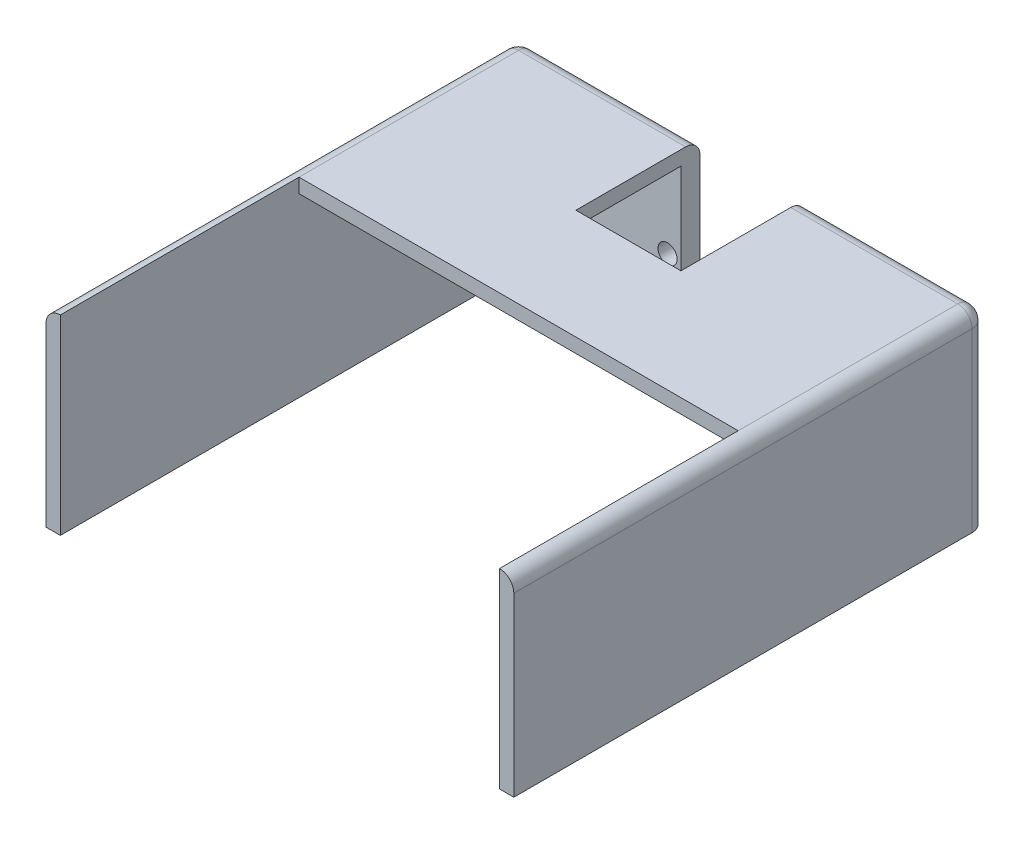
ISO-10303-21;
HEADER;
FILE_DESCRIPTION(('STEP AP214'),'2;1');
FILE_NAME('part.step','',(''),(''),'','','');
FILE_SCHEMA(('AUTOMOTIVE_DESIGN { 1 0 10303 214 1 1 1 1 }'));
ENDSEC;
DATA;
#1=APPLICATION_CONTEXT('core data for automotive mechanical design processes');
#2=APPLICATION_PROTOCOL_DEFINITION('international standard','automotive_design',2000,#1);
#3=PRODUCT_CONTEXT('',#1,'mechanical');
#4=PRODUCT('Part','Part','',(#3));
#5=PRODUCT_RELATED_PRODUCT_CATEGORY('part','',(#4));
#6=PRODUCT_DEFINITION_FORMATION('','',#4);
#7=PRODUCT_DEFINITION_CONTEXT('part definition',#1,'design');
#8=PRODUCT_DEFINITION('design','',#6,#7);
#9=PRODUCT_DEFINITION_SHAPE('','',#8);
#10=(LENGTH_UNIT() NAMED_UNIT(*) SI_UNIT(.MILLI.,.METRE.));
#11=(NAMED_UNIT(*) PLANE_ANGLE_UNIT() SI_UNIT($,.RADIAN.));
#12=(NAMED_UNIT(*) SI_UNIT($,.STERADIAN.) SOLID_ANGLE_UNIT());
#13=UNCERTAINTY_MEASURE_WITH_UNIT(LENGTH_MEASURE(1.E-05),#10,'distance_accuracy_value','');
#14=(GEOMETRIC_REPRESENTATION_CONTEXT(3) GLOBAL_UNCERTAINTY_ASSIGNED_CONTEXT((#13)) GLOBAL_UNIT_ASSIGNED_CONTEXT((#10,
#11,#12)) REPRESENTATION_CONTEXT('',''));
#15=CARTESIAN_POINT('',(0.,0.,0.));
#16=DIRECTION('',(0.,0.,1.));
#17=DIRECTION('',(1.,0.,0.));
#18=AXIS2_PLACEMENT_3D('',#15,#16,#17);
#19=CARTESIAN_POINT('',(0.,17.,3.));
#20=DIRECTION('',(-1.,0.,0.));
#21=DIRECTION('',(0.,-1.,0.));
#22=AXIS2_PLACEMENT_3D('',#19,#20,#21);
#23=CYLINDRICAL_SURFACE('',#22,3.);
#24=CARTESIAN_POINT('',(11.,17.,3.));
#25=DIRECTION('',(1.,0.,0.));
#26=DIRECTION('',(0.,1.,0.));
#27=AXIS2_PLACEMENT_3D('',#24,#25,#26);
#28=CIRCLE('',#27,3.);
#29=CARTESIAN_POINT('',(11.,20.,3.));
#30=VERTEX_POINT('',#29);
#31=CARTESIAN_POINT('',(11.,17.,0.));
#32=VERTEX_POINT('',#31);
#33=EDGE_CURVE('E46',#30,#32,#28,.F.);
#34=ORIENTED_EDGE('',*,*,#33,.F.);
#35=DIRECTION('',(1.,0.,0.));
#36=VECTOR('',#35,1.);
#37=CARTESIAN_POINT('',(-46.,20.,3.));
#38=LINE('',#37,#36);
#39=CARTESIAN_POINT('',(46.,20.,3.));
#40=VERTEX_POINT('',#39);
#41=EDGE_CURVE('E303',#40,#30,#38,.F.);
#42=ORIENTED_EDGE('',*,*,#41,.F.);
#43=CARTESIAN_POINT('',(46.,17.,3.));
#44=DIRECTION('',(-1.,0.,0.));
#45=DIRECTION('',(0.,0.,1.));
#46=AXIS2_PLACEMENT_3D('',#43,#44,#45);
#47=CIRCLE('',#46,3.);
#48=CARTESIAN_POINT('',(46.,17.,0.));
#49=VERTEX_POINT('',#48);
#50=EDGE_CURVE('E321',#40,#49,#47,.T.);
#51=ORIENTED_EDGE('',*,*,#50,.T.);
#52=DIRECTION('',(1.,0.,0.));
#53=VECTOR('',#52,1.);
#54=CARTESIAN_POINT('',(46.,17.,0.));
#55=LINE('',#54,#53);
#56=EDGE_CURVE('E296',#32,#49,#55,.T.);
#57=ORIENTED_EDGE('',*,*,#56,.F.);
#58=EDGE_LOOP('',(#34,#42,#51,#57));
#59=FACE_BOUND('',#58,.T.);
#60=ADVANCED_FACE('F38',(#59),#23,.T.);
#61=CARTESIAN_POINT('',(0.,0.,4.));
#62=DIRECTION('',(0.,0.,1.));
#63=DIRECTION('',(1.,0.,0.));
#64=AXIS2_PLACEMENT_3D('',#61,#62,#63);
#65=PLANE('',#64);
#66=CARTESIAN_POINT('',(-13.8,-0.300220534192911,4.));
#67=DIRECTION('',(0.,0.,1.));
#68=DIRECTION('',(1.,0.,0.));
#69=AXIS2_PLACEMENT_3D('',#66,#67,#68);
#70=CIRCLE('',#69,2.);
#71=CARTESIAN_POINT('',(-11.8,-0.300220534192911,4.));
#72=VERTEX_POINT('',#71);
#73=EDGE_CURVE('E201',#72,#72,#70,.T.);
#74=ORIENTED_EDGE('',*,*,#73,.F.);
#75=EDGE_LOOP('',(#74));
#76=FACE_BOUND('',#75,.T.);
#77=CARTESIAN_POINT('',(13.7335873865673,-10.3,4.));
#78=DIRECTION('',(0.,0.,1.));
#79=DIRECTION('',(1.,0.,0.));
#80=AXIS2_PLACEMENT_3D('',#77,#78,#79);
#81=CIRCLE('',#80,2.00000000000001);
#82=CARTESIAN_POINT('',(15.7335873865673,-10.3,4.));
#83=VERTEX_POINT('',#82);
#84=EDGE_CURVE('E669',#83,#83,#81,.T.);
#85=ORIENTED_EDGE('',*,*,#84,.F.);
#86=EDGE_LOOP('',(#85));
#87=FACE_BOUND('',#86,.T.);
#88=CARTESIAN_POINT('',(-13.7335873865673,-10.3,4.));
#89=DIRECTION('',(0.,0.,1.));
#90=DIRECTION('',(1.,0.,0.));
#91=AXIS2_PLACEMENT_3D('',#88,#89,#90);
#92=CIRCLE('',#91,2.00000000000001);
#93=CARTESIAN_POINT('',(-11.7335873865673,-10.3,4.));
#94=VERTEX_POINT('',#93);
#95=EDGE_CURVE('E666',#94,#94,#92,.T.);
#96=ORIENTED_EDGE('',*,*,#95,.F.);
#97=EDGE_LOOP('',(#96));
#98=FACE_BOUND('',#97,.T.);
#99=CARTESIAN_POINT('',(4.99999999999999,-15.,4.));
#100=DIRECTION('',(0.,0.,1.));
#101=DIRECTION('',(1.,0.,0.));
#102=AXIS2_PLACEMENT_3D('',#99,#100,#101);
#103=CIRCLE('',#102,2.);
#104=CARTESIAN_POINT('',(6.99999999999999,-15.,4.));
#105=VERTEX_POINT('',#104);
#106=EDGE_CURVE('E663',#105,#105,#103,.T.);
#107=ORIENTED_EDGE('',*,*,#106,.F.);
#108=EDGE_LOOP('',(#107));
#109=FACE_BOUND('',#108,.T.);
#110=CARTESIAN_POINT('',(13.8,-0.300220534192911,4.));
#111=DIRECTION('',(0.,0.,1.));
#112=DIRECTION('',(1.,0.,0.));
#113=AXIS2_PLACEMENT_3D('',#110,#111,#112);
#114=CIRCLE('',#113,2.);
#115=CARTESIAN_POINT('',(15.8,-0.300220534192911,4.));
#116=VERTEX_POINT('',#115);
#117=EDGE_CURVE('E660',#116,#116,#114,.T.);
#118=ORIENTED_EDGE('',*,*,#117,.F.);
#119=EDGE_LOOP('',(#118));
#120=FACE_BOUND('',#119,.T.);
#121=CARTESIAN_POINT('',(-5.00000000000001,-15.,4.));
#122=DIRECTION('',(0.,0.,1.));
#123=DIRECTION('',(1.,0.,0.));
#124=AXIS2_PLACEMENT_3D('',#121,#122,#123);
#125=CIRCLE('',#124,2.);
#126=CARTESIAN_POINT('',(-3.00000000000001,-15.,4.));
#127=VERTEX_POINT('',#126);
#128=EDGE_CURVE('E657',#127,#127,#125,.T.);
#129=ORIENTED_EDGE('',*,*,#128,.F.);
#130=EDGE_LOOP('',(#129));
#131=FACE_BOUND('',#130,.T.);
#132=DIRECTION('',(0.,1.,0.));
#133=VECTOR('',#132,1.);
#134=CARTESIAN_POINT('',(11.,0.,4.));
#135=LINE('',#134,#133);
#136=CARTESIAN_POINT('',(11.,-9.99999999999999,4.));
#137=VERTEX_POINT('',#136);
#138=CARTESIAN_POINT('',(11.,17.,4.));
#139=VERTEX_POINT('',#138);
#140=EDGE_CURVE('E214',#137,#139,#135,.T.);
#141=ORIENTED_EDGE('',*,*,#140,.F.);
#142=DIRECTION('',(1.,0.,0.));
#143=VECTOR('',#142,1.);
#144=CARTESIAN_POINT('',(0.,-9.99999999999999,4.));
#145=LINE('',#144,#143);
#146=CARTESIAN_POINT('',(-11.,-9.99999999999999,4.));
#147=VERTEX_POINT('',#146);
#148=EDGE_CURVE('E216',#147,#137,#145,.T.);
#149=ORIENTED_EDGE('',*,*,#148,.F.);
#150=DIRECTION('',(0.,-1.,0.));
#151=VECTOR('',#150,1.);
#152=CARTESIAN_POINT('',(-11.,0.,4.));
#153=LINE('',#152,#151);
#154=CARTESIAN_POINT('',(-11.,17.,4.));
#155=VERTEX_POINT('',#154);
#156=EDGE_CURVE('E209',#155,#147,#153,.T.);
#157=ORIENTED_EDGE('',*,*,#156,.F.);
#158=DIRECTION('',(1.,0.,0.));
#159=VECTOR('',#158,1.);
#160=CARTESIAN_POINT('',(-46.,17.,4.));
#161=LINE('',#160,#159);
#162=CARTESIAN_POINT('',(-46.,17.,4.));
#163=VERTEX_POINT('',#162);
#164=EDGE_CURVE('E223',#163,#155,#161,.T.);
#165=ORIENTED_EDGE('',*,*,#164,.F.);
#166=DIRECTION('',(0.,1.,0.));
#167=VECTOR('',#166,1.);
#168=CARTESIAN_POINT('',(-46.,-20.,4.));
#169=LINE('',#168,#167);
#170=CARTESIAN_POINT('',(-46.,-20.,4.));
#171=VERTEX_POINT('',#170);
#172=EDGE_CURVE('E238',#171,#163,#169,.T.);
#173=ORIENTED_EDGE('',*,*,#172,.F.);
#174=DIRECTION('',(1.,0.,0.));
#175=VECTOR('',#174,1.);
#176=CARTESIAN_POINT('',(0.,-20.,4.));
#177=LINE('',#176,#175);
#178=CARTESIAN_POINT('',(46.,-20.,4.));
#179=VERTEX_POINT('',#178);
#180=EDGE_CURVE('E274',#171,#179,#177,.T.);
#181=ORIENTED_EDGE('',*,*,#180,.T.);
#182=DIRECTION('',(0.,-1.,0.));
#183=VECTOR('',#182,1.);
#184=CARTESIAN_POINT('',(46.,-20.,4.));
#185=LINE('',#184,#183);
#186=CARTESIAN_POINT('',(46.,17.,4.));
#187=VERTEX_POINT('',#186);
#188=EDGE_CURVE('E255',#187,#179,#185,.T.);
#189=ORIENTED_EDGE('',*,*,#188,.F.);
#190=EDGE_CURVE('E233',#139,#187,#161,.T.);
#191=ORIENTED_EDGE('',*,*,#190,.F.);
#192=EDGE_LOOP('',(#141,#149,#157,#165,#173,#181,#189,#191));
#193=FACE_BOUND('',#192,.T.);
#194=ADVANCED_FACE('F399',(#76,#87,#98,#109,#120,#131,#193),#65,.T.);
#195=CARTESIAN_POINT('',(46.,-20.,99.));
#196=DIRECTION('',(1.,0.,0.));
#197=DIRECTION('',(0.,0.,-1.));
#198=AXIS2_PLACEMENT_3D('',#195,#196,#197);
#199=PLANE('',#198);
#200=DIRECTION('',(0.,0.,-1.));
#201=VECTOR('',#200,1.);
#202=CARTESIAN_POINT('',(46.,17.,49.));
#203=LINE('',#202,#201);
#204=CARTESIAN_POINT('',(46.,17.,49.));
#205=VERTEX_POINT('',#204);
#206=EDGE_CURVE('E230',#205,#187,#203,.T.);
#207=ORIENTED_EDGE('',*,*,#206,.T.);
#208=ORIENTED_EDGE('',*,*,#188,.T.);
#209=DIRECTION('',(0.,0.,-1.));
#210=VECTOR('',#209,1.);
#211=CARTESIAN_POINT('',(46.,-20.,99.));
#212=LINE('',#211,#210);
#213=CARTESIAN_POINT('',(46.,-20.,99.));
#214=VERTEX_POINT('',#213);
#215=EDGE_CURVE('E264',#214,#179,#212,.T.);
#216=ORIENTED_EDGE('',*,*,#215,.F.);
#217=DIRECTION('',(0.,-1.,0.));
#218=VECTOR('',#217,1.);
#219=CARTESIAN_POINT('',(46.,-20.,99.));
#220=LINE('',#219,#218);
#221=CARTESIAN_POINT('',(46.,20.,99.));
#222=VERTEX_POINT('',#221);
#223=EDGE_CURVE('E259',#222,#214,#220,.T.);
#224=ORIENTED_EDGE('',*,*,#223,.F.);
#225=DIRECTION('',(0.,0.,-1.));
#226=VECTOR('',#225,1.);
#227=CARTESIAN_POINT('',(46.,20.,99.));
#228=LINE('',#227,#226);
#229=CARTESIAN_POINT('',(46.,20.,49.));
#230=VERTEX_POINT('',#229);
#231=EDGE_CURVE('E268',#222,#230,#228,.T.);
#232=ORIENTED_EDGE('',*,*,#231,.T.);
#233=DIRECTION('',(0.,1.,0.));
#234=VECTOR('',#233,1.);
#235=CARTESIAN_POINT('',(46.,20.,49.));
#236=LINE('',#235,#234);
#237=EDGE_CURVE('E225',#205,#230,#236,.T.);
#238=ORIENTED_EDGE('',*,*,#237,.F.);
#239=EDGE_LOOP('',(#207,#208,#216,#224,#232,#238));
#240=FACE_BOUND('',#239,.T.);
#241=ADVANCED_FACE('F362',(#240),#199,.F.);
#242=CARTESIAN_POINT('',(-46.,-20.,99.));
#243=DIRECTION('',(-1.,0.,0.));
#244=DIRECTION('',(0.,0.,1.));
#245=AXIS2_PLACEMENT_3D('',#242,#243,#244);
#246=PLANE('',#245);
#247=DIRECTION('',(0.,0.,-1.));
#248=VECTOR('',#247,1.);
#249=CARTESIAN_POINT('',(-46.,17.,49.));
#250=LINE('',#249,#248);
#251=CARTESIAN_POINT('',(-46.,17.,49.));
#252=VERTEX_POINT('',#251);
#253=EDGE_CURVE('E236',#252,#163,#250,.T.);
#254=ORIENTED_EDGE('',*,*,#253,.F.);
#255=DIRECTION('',(0.,-1.,0.));
#256=VECTOR('',#255,1.);
#257=CARTESIAN_POINT('',(-46.,20.,49.));
#258=LINE('',#257,#256);
#259=CARTESIAN_POINT('',(-46.,20.,49.));
#260=VERTEX_POINT('',#259);
#261=EDGE_CURVE('E219',#260,#252,#258,.T.);
#262=ORIENTED_EDGE('',*,*,#261,.F.);
#263=DIRECTION('',(0.,0.,-1.));
#264=VECTOR('',#263,1.);
#265=CARTESIAN_POINT('',(-46.,20.,99.));
#266=LINE('',#265,#264);
#267=CARTESIAN_POINT('',(-46.,20.,99.));
#268=VERTEX_POINT('',#267);
#269=EDGE_CURVE('E249',#268,#260,#266,.T.);
#270=ORIENTED_EDGE('',*,*,#269,.F.);
#271=DIRECTION('',(0.,1.,0.));
#272=VECTOR('',#271,1.);
#273=CARTESIAN_POINT('',(-46.,-20.,99.));
#274=LINE('',#273,#272);
#275=CARTESIAN_POINT('',(-46.,-20.,99.));
#276=VERTEX_POINT('',#275);
#277=EDGE_CURVE('E239',#276,#268,#274,.T.);
#278=ORIENTED_EDGE('',*,*,#277,.F.);
#279=DIRECTION('',(0.,0.,-1.));
#280=VECTOR('',#279,1.);
#281=CARTESIAN_POINT('',(-46.,-20.,99.));
#282=LINE('',#281,#280);
#283=EDGE_CURVE('E245',#276,#171,#282,.T.);
#284=ORIENTED_EDGE('',*,*,#283,.T.);
#285=ORIENTED_EDGE('',*,*,#172,.T.);
#286=EDGE_LOOP('',(#254,#262,#270,#278,#284,#285));
#287=FACE_BOUND('',#286,.T.);
#288=ADVANCED_FACE('F408',(#287),#246,.F.);
#289=CARTESIAN_POINT('',(0.,-20.,4.));
#290=DIRECTION('',(0.,1.,0.));
#291=DIRECTION('',(0.,0.,1.));
#292=AXIS2_PLACEMENT_3D('',#289,#290,#291);
#293=PLANE('',#292);
#294=DIRECTION('',(1.,0.,0.));
#295=VECTOR('',#294,1.);
#296=CARTESIAN_POINT('',(0.,-20.,0.));
#297=LINE('',#296,#295);
#298=CARTESIAN_POINT('',(-46.,-20.,0.));
#299=VERTEX_POINT('',#298);
#300=CARTESIAN_POINT('',(46.,-20.,0.));
#301=VERTEX_POINT('',#300);
#302=EDGE_CURVE('E273',#299,#301,#297,.T.);
#303=ORIENTED_EDGE('',*,*,#302,.T.);
#304=CARTESIAN_POINT('',(46.,-20.,3.));
#305=DIRECTION('',(0.,1.,0.));
#306=DIRECTION('',(0.,0.,1.));
#307=AXIS2_PLACEMENT_3D('',#304,#305,#306);
#308=CIRCLE('',#307,3.);
#309=CARTESIAN_POINT('',(49.,-20.,3.));
#310=VERTEX_POINT('',#309);
#311=EDGE_CURVE('E286',#301,#310,#308,.F.);
#312=ORIENTED_EDGE('',*,*,#311,.T.);
#313=DIRECTION('',(0.,0.,1.));
#314=VECTOR('',#313,1.);
#315=CARTESIAN_POINT('',(49.,-20.,0.));
#316=LINE('',#315,#314);
#317=CARTESIAN_POINT('',(49.,-20.,99.));
#318=VERTEX_POINT('',#317);
#319=EDGE_CURVE('E271',#310,#318,#316,.T.);
#320=ORIENTED_EDGE('',*,*,#319,.T.);
#321=DIRECTION('',(1.,0.,0.));
#322=VECTOR('',#321,1.);
#323=CARTESIAN_POINT('',(49.,-20.,99.));
#324=LINE('',#323,#322);
#325=EDGE_CURVE('E261',#214,#318,#324,.T.);
#326=ORIENTED_EDGE('',*,*,#325,.F.);
#327=ORIENTED_EDGE('',*,*,#215,.T.);
#328=ORIENTED_EDGE('',*,*,#180,.F.);
#329=ORIENTED_EDGE('',*,*,#283,.F.);
#330=DIRECTION('',(1.,0.,0.));
#331=VECTOR('',#330,1.);
#332=CARTESIAN_POINT('',(-49.,-20.,99.));
#333=LINE('',#332,#331);
#334=CARTESIAN_POINT('',(-49.,-20.,99.));
#335=VERTEX_POINT('',#334);
#336=EDGE_CURVE('E243',#335,#276,#333,.T.);
#337=ORIENTED_EDGE('',*,*,#336,.F.);
#338=DIRECTION('',(0.,0.,1.));
#339=VECTOR('',#338,1.);
#340=CARTESIAN_POINT('',(-49.,-20.,0.));
#341=LINE('',#340,#339);
#342=CARTESIAN_POINT('',(-49.,-20.,3.));
#343=VERTEX_POINT('',#342);
#344=EDGE_CURVE('E252',#343,#335,#341,.T.);
#345=ORIENTED_EDGE('',*,*,#344,.F.);
#346=CARTESIAN_POINT('',(-46.,-20.,3.));
#347=DIRECTION('',(0.,1.,0.));
#348=DIRECTION('',(0.,0.,1.));
#349=AXIS2_PLACEMENT_3D('',#346,#347,#348);
#350=CIRCLE('',#349,3.);
#351=EDGE_CURVE('E284',#343,#299,#350,.F.);
#352=ORIENTED_EDGE('',*,*,#351,.T.);
#353=EDGE_LOOP('',(#303,#312,#320,#326,#327,#328,#329,#337,#345,#352));
#354=FACE_BOUND('',#353,.T.);
#355=ADVANCED_FACE('F368',(#354),#293,.F.);
#356=CARTESIAN_POINT('',(0.,20.,4.));
#357=DIRECTION('',(0.,1.,0.));
#358=DIRECTION('',(-1.,0.,0.));
#359=AXIS2_PLACEMENT_3D('',#356,#357,#358);
#360=PLANE('',#359);
#361=DIRECTION('',(0.,0.,-1.));
#362=VECTOR('',#361,1.);
#363=CARTESIAN_POINT('',(11.,20.,26.));
#364=LINE('',#363,#362);
#365=CARTESIAN_POINT('',(11.,20.,26.));
#366=VERTEX_POINT('',#365);
#367=EDGE_CURVE('E187',#366,#30,#364,.T.);
#368=ORIENTED_EDGE('',*,*,#367,.F.);
#369=DIRECTION('',(1.,0.,0.));
#370=VECTOR('',#369,1.);
#371=CARTESIAN_POINT('',(11.,20.,26.));
#372=LINE('',#371,#370);
#373=CARTESIAN_POINT('',(-11.,20.,26.));
#374=VERTEX_POINT('',#373);
#375=EDGE_CURVE('E176',#374,#366,#372,.T.);
#376=ORIENTED_EDGE('',*,*,#375,.F.);
#377=DIRECTION('',(0.,0.,-1.));
#378=VECTOR('',#377,1.);
#379=CARTESIAN_POINT('',(-11.,20.,26.));
#380=LINE('',#379,#378);
#381=CARTESIAN_POINT('',(-11.,20.,3.));
#382=VERTEX_POINT('',#381);
#383=EDGE_CURVE('E182',#374,#382,#380,.T.);
#384=ORIENTED_EDGE('',*,*,#383,.T.);
#385=CARTESIAN_POINT('',(-46.,20.,3.));
#386=VERTEX_POINT('',#385);
#387=EDGE_CURVE('E302',#382,#386,#38,.F.);
#388=ORIENTED_EDGE('',*,*,#387,.T.);
#389=DIRECTION('',(0.,0.,1.));
#390=VECTOR('',#389,1.);
#391=CARTESIAN_POINT('',(-46.,20.,99.));
#392=LINE('',#391,#390);
#393=EDGE_CURVE('E305',#386,#260,#392,.T.);
#394=ORIENTED_EDGE('',*,*,#393,.T.);
#395=DIRECTION('',(-1.,0.,0.));
#396=VECTOR('',#395,1.);
#397=CARTESIAN_POINT('',(-46.,20.,49.));
#398=LINE('',#397,#396);
#399=EDGE_CURVE('E227',#230,#260,#398,.T.);
#400=ORIENTED_EDGE('',*,*,#399,.F.);
#401=DIRECTION('',(0.,0.,1.));
#402=VECTOR('',#401,1.);
#403=CARTESIAN_POINT('',(46.,20.,3.));
#404=LINE('',#403,#402);
#405=EDGE_CURVE('E300',#230,#40,#404,.F.);
#406=ORIENTED_EDGE('',*,*,#405,.T.);
#407=ORIENTED_EDGE('',*,*,#41,.T.);
#408=EDGE_LOOP('',(#368,#376,#384,#388,#394,#400,#406,#407));
#409=FACE_BOUND('',#408,.T.);
#410=ADVANCED_FACE('F190',(#409),#360,.T.);
#411=CARTESIAN_POINT('',(0.,0.,0.));
#412=DIRECTION('',(0.,0.,1.));
#413=DIRECTION('',(1.,0.,0.));
#414=AXIS2_PLACEMENT_3D('',#411,#412,#413);
#415=PLANE('',#414);
#416=CARTESIAN_POINT('',(-13.8,-0.300220534192911,0.));
#417=DIRECTION('',(0.,0.,-1.));
#418=DIRECTION('',(-1.,0.,0.));
#419=AXIS2_PLACEMENT_3D('',#416,#417,#418);
#420=CIRCLE('',#419,2.);
#421=CARTESIAN_POINT('',(-15.8,-0.300220534192911,0.));
#422=VERTEX_POINT('',#421);
#423=EDGE_CURVE('E639',#422,#422,#420,.T.);
#424=ORIENTED_EDGE('',*,*,#423,.F.);
#425=EDGE_LOOP('',(#424));
#426=FACE_BOUND('',#425,.T.);
#427=CARTESIAN_POINT('',(13.7335873865673,-10.3,0.));
#428=DIRECTION('',(0.,0.,-1.));
#429=DIRECTION('',(1.,0.,0.));
#430=AXIS2_PLACEMENT_3D('',#427,#428,#429);
#431=CIRCLE('',#430,2.00000000000001);
#432=CARTESIAN_POINT('',(15.7335873865673,-10.3,0.));
#433=VERTEX_POINT('',#432);
#434=EDGE_CURVE('E640',#433,#433,#431,.T.);
#435=ORIENTED_EDGE('',*,*,#434,.F.);
#436=EDGE_LOOP('',(#435));
#437=FACE_BOUND('',#436,.T.);
#438=CARTESIAN_POINT('',(-13.7335873865673,-10.3,0.));
#439=DIRECTION('',(0.,0.,-1.));
#440=DIRECTION('',(-1.,0.,0.));
#441=AXIS2_PLACEMENT_3D('',#438,#439,#440);
#442=CIRCLE('',#441,2.00000000000001);
#443=CARTESIAN_POINT('',(-15.7335873865673,-10.3,0.));
#444=VERTEX_POINT('',#443);
#445=EDGE_CURVE('E644',#444,#444,#442,.T.);
#446=ORIENTED_EDGE('',*,*,#445,.F.);
#447=EDGE_LOOP('',(#446));
#448=FACE_BOUND('',#447,.T.);
#449=CARTESIAN_POINT('',(4.99999999999999,-15.,0.));
#450=DIRECTION('',(0.,0.,-1.));
#451=DIRECTION('',(-1.,0.,0.));
#452=AXIS2_PLACEMENT_3D('',#449,#450,#451);
#453=CIRCLE('',#452,2.);
#454=CARTESIAN_POINT('',(2.99999999999999,-15.,0.));
#455=VERTEX_POINT('',#454);
#456=EDGE_CURVE('E649',#455,#455,#453,.T.);
#457=ORIENTED_EDGE('',*,*,#456,.F.);
#458=EDGE_LOOP('',(#457));
#459=FACE_BOUND('',#458,.T.);
#460=CARTESIAN_POINT('',(13.8,-0.300220534192911,0.));
#461=DIRECTION('',(0.,0.,-1.));
#462=DIRECTION('',(1.,0.,0.));
#463=AXIS2_PLACEMENT_3D('',#460,#461,#462);
#464=CIRCLE('',#463,2.);
#465=CARTESIAN_POINT('',(15.8,-0.300220534192911,0.));
#466=VERTEX_POINT('',#465);
#467=EDGE_CURVE('E641',#466,#466,#464,.T.);
#468=ORIENTED_EDGE('',*,*,#467,.F.);
#469=EDGE_LOOP('',(#468));
#470=FACE_BOUND('',#469,.T.);
#471=CARTESIAN_POINT('',(-5.00000000000001,-15.,0.));
#472=DIRECTION('',(0.,0.,-1.));
#473=DIRECTION('',(-1.,0.,0.));
#474=AXIS2_PLACEMENT_3D('',#471,#472,#473);
#475=CIRCLE('',#474,2.);
#476=CARTESIAN_POINT('',(-7.00000000000001,-15.,0.));
#477=VERTEX_POINT('',#476);
#478=EDGE_CURVE('E652',#477,#477,#475,.T.);
#479=ORIENTED_EDGE('',*,*,#478,.F.);
#480=EDGE_LOOP('',(#479));
#481=FACE_BOUND('',#480,.T.);
#482=DIRECTION('',(-1.,0.,0.));
#483=VECTOR('',#482,1.);
#484=CARTESIAN_POINT('',(11.,-9.99999999999999,0.));
#485=LINE('',#484,#483);
#486=CARTESIAN_POINT('',(11.,-9.99999999999999,0.));
#487=VERTEX_POINT('',#486);
#488=CARTESIAN_POINT('',(-11.,-9.99999999999999,0.));
#489=VERTEX_POINT('',#488);
#490=EDGE_CURVE('E200',#487,#489,#485,.T.);
#491=ORIENTED_EDGE('',*,*,#490,.F.);
#492=DIRECTION('',(0.,-1.,0.));
#493=VECTOR('',#492,1.);
#494=CARTESIAN_POINT('',(11.,20.,0.));
#495=LINE('',#494,#493);
#496=EDGE_CURVE('E197',#32,#487,#495,.T.);
#497=ORIENTED_EDGE('',*,*,#496,.F.);
#498=ORIENTED_EDGE('',*,*,#56,.T.);
#499=DIRECTION('',(0.,-1.,0.));
#500=VECTOR('',#499,1.);
#501=CARTESIAN_POINT('',(46.,0.,0.));
#502=LINE('',#501,#500);
#503=EDGE_CURVE('E282',#49,#301,#502,.T.);
#504=ORIENTED_EDGE('',*,*,#503,.T.);
#505=ORIENTED_EDGE('',*,*,#302,.F.);
#506=DIRECTION('',(0.,1.,0.));
#507=VECTOR('',#506,1.);
#508=CARTESIAN_POINT('',(-46.,0.,0.));
#509=LINE('',#508,#507);
#510=CARTESIAN_POINT('',(-46.,17.,0.));
#511=VERTEX_POINT('',#510);
#512=EDGE_CURVE('E277',#299,#511,#509,.T.);
#513=ORIENTED_EDGE('',*,*,#512,.T.);
#514=CARTESIAN_POINT('',(-11.,17.,0.));
#515=VERTEX_POINT('',#514);
#516=EDGE_CURVE('E297',#511,#515,#55,.T.);
#517=ORIENTED_EDGE('',*,*,#516,.T.);
#518=DIRECTION('',(0.,1.,0.));
#519=VECTOR('',#518,1.);
#520=CARTESIAN_POINT('',(-11.,20.,0.));
#521=LINE('',#520,#519);
#522=EDGE_CURVE('E60',#489,#515,#521,.T.);
#523=ORIENTED_EDGE('',*,*,#522,.F.);
#524=EDGE_LOOP('',(#491,#497,#498,#504,#505,#513,#517,#523));
#525=FACE_BOUND('',#524,.T.);
#526=ADVANCED_FACE('F337',(#426,#437,#448,#459,#470,#481,#525),#415,.F.);
#527=CARTESIAN_POINT('',(49.,20.,0.));
#528=DIRECTION('',(-1.,0.,0.));
#529=DIRECTION('',(0.,0.,1.));
#530=AXIS2_PLACEMENT_3D('',#527,#528,#529);
#531=PLANE('',#530);
#532=DIRECTION('',(0.,-1.,0.));
#533=VECTOR('',#532,1.);
#534=CARTESIAN_POINT('',(49.,20.,3.));
#535=LINE('',#534,#533);
#536=CARTESIAN_POINT('',(49.,17.,3.));
#537=VERTEX_POINT('',#536);
#538=EDGE_CURVE('E288',#310,#537,#535,.F.);
#539=ORIENTED_EDGE('',*,*,#538,.T.);
#540=DIRECTION('',(0.,0.,1.));
#541=VECTOR('',#540,1.);
#542=CARTESIAN_POINT('',(49.,17.,99.));
#543=LINE('',#542,#541);
#544=CARTESIAN_POINT('',(49.,17.,99.));
#545=VERTEX_POINT('',#544);
#546=EDGE_CURVE('E313',#537,#545,#543,.T.);
#547=ORIENTED_EDGE('',*,*,#546,.T.);
#548=DIRECTION('',(0.,1.,0.));
#549=VECTOR('',#548,1.);
#550=CARTESIAN_POINT('',(49.,-20.,99.));
#551=LINE('',#550,#549);
#552=EDGE_CURVE('E256',#318,#545,#551,.T.);
#553=ORIENTED_EDGE('',*,*,#552,.F.);
#554=ORIENTED_EDGE('',*,*,#319,.F.);
#555=EDGE_LOOP('',(#539,#547,#553,#554));
#556=FACE_BOUND('',#555,.T.);
#557=ADVANCED_FACE('F351',(#556),#531,.F.);
#558=CARTESIAN_POINT('',(0.,0.,99.));
#559=DIRECTION('',(0.,0.,1.));
#560=DIRECTION('',(1.,0.,0.));
#561=AXIS2_PLACEMENT_3D('',#558,#559,#560);
#562=PLANE('',#561);
#563=ORIENTED_EDGE('',*,*,#552,.T.);
#564=CARTESIAN_POINT('',(46.,17.,99.));
#565=DIRECTION('',(0.,0.,1.));
#566=DIRECTION('',(1.,0.,0.));
#567=AXIS2_PLACEMENT_3D('',#564,#565,#566);
#568=CIRCLE('',#567,3.);
#569=EDGE_CURVE('E315',#545,#222,#568,.T.);
#570=ORIENTED_EDGE('',*,*,#569,.T.);
#571=ORIENTED_EDGE('',*,*,#223,.T.);
#572=ORIENTED_EDGE('',*,*,#325,.T.);
#573=EDGE_LOOP('',(#563,#570,#571,#572));
#574=FACE_BOUND('',#573,.T.);
#575=ADVANCED_FACE('F359',(#574),#562,.T.);
#576=CARTESIAN_POINT('',(-49.,20.,0.));
#577=DIRECTION('',(1.,0.,0.));
#578=DIRECTION('',(0.,0.,-1.));
#579=AXIS2_PLACEMENT_3D('',#576,#577,#578);
#580=PLANE('',#579);
#581=DIRECTION('',(0.,-1.,0.));
#582=VECTOR('',#581,1.);
#583=CARTESIAN_POINT('',(-49.,-20.,99.));
#584=LINE('',#583,#582);
#585=CARTESIAN_POINT('',(-49.,17.,99.));
#586=VERTEX_POINT('',#585);
#587=EDGE_CURVE('E241',#586,#335,#584,.T.);
#588=ORIENTED_EDGE('',*,*,#587,.F.);
#589=DIRECTION('',(0.,0.,1.));
#590=VECTOR('',#589,1.);
#591=CARTESIAN_POINT('',(-49.,17.,3.));
#592=LINE('',#591,#590);
#593=CARTESIAN_POINT('',(-49.,17.,3.));
#594=VERTEX_POINT('',#593);
#595=EDGE_CURVE('E311',#586,#594,#592,.F.);
#596=ORIENTED_EDGE('',*,*,#595,.T.);
#597=DIRECTION('',(0.,1.,0.));
#598=VECTOR('',#597,1.);
#599=CARTESIAN_POINT('',(-49.,20.,3.));
#600=LINE('',#599,#598);
#601=EDGE_CURVE('E291',#594,#343,#600,.F.);
#602=ORIENTED_EDGE('',*,*,#601,.T.);
#603=ORIENTED_EDGE('',*,*,#344,.T.);
#604=EDGE_LOOP('',(#588,#596,#602,#603));
#605=FACE_BOUND('',#604,.T.);
#606=ADVANCED_FACE('F455',(#605),#580,.F.);
#607=CARTESIAN_POINT('',(0.,0.,99.));
#608=DIRECTION('',(0.,0.,-1.));
#609=DIRECTION('',(-1.,0.,0.));
#610=AXIS2_PLACEMENT_3D('',#607,#608,#609);
#611=PLANE('',#610);
#612=ORIENTED_EDGE('',*,*,#277,.T.);
#613=CARTESIAN_POINT('',(-46.,17.,99.));
#614=DIRECTION('',(0.,0.,-1.));
#615=DIRECTION('',(-1.,0.,0.));
#616=AXIS2_PLACEMENT_3D('',#613,#614,#615);
#617=CIRCLE('',#616,3.);
#618=EDGE_CURVE('E309',#268,#586,#617,.F.);
#619=ORIENTED_EDGE('',*,*,#618,.T.);
#620=ORIENTED_EDGE('',*,*,#587,.T.);
#621=ORIENTED_EDGE('',*,*,#336,.T.);
#622=EDGE_LOOP('',(#612,#619,#620,#621));
#623=FACE_BOUND('',#622,.T.);
#624=ADVANCED_FACE('F423',(#623),#611,.F.);
#625=CARTESIAN_POINT('',(46.,0.,3.));
#626=DIRECTION('',(0.,-1.,0.));
#627=DIRECTION('',(0.,0.,-1.));
#628=AXIS2_PLACEMENT_3D('',#625,#626,#627);
#629=CYLINDRICAL_SURFACE('',#628,3.);
#630=ORIENTED_EDGE('',*,*,#503,.F.);
#631=CARTESIAN_POINT('',(46.,17.,3.));
#632=DIRECTION('',(0.,-1.,0.));
#633=DIRECTION('',(0.,0.,-1.));
#634=AXIS2_PLACEMENT_3D('',#631,#632,#633);
#635=CIRCLE('',#634,3.);
#636=EDGE_CURVE('E307',#49,#537,#635,.T.);
#637=ORIENTED_EDGE('',*,*,#636,.T.);
#638=ORIENTED_EDGE('',*,*,#538,.F.);
#639=ORIENTED_EDGE('',*,*,#311,.F.);
#640=EDGE_LOOP('',(#630,#637,#638,#639));
#641=FACE_BOUND('',#640,.T.);
#642=ADVANCED_FACE('F346',(#641),#629,.T.);
#643=CARTESIAN_POINT('',(-46.,0.,3.));
#644=DIRECTION('',(0.,1.,0.));
#645=DIRECTION('',(0.,0.,1.));
#646=AXIS2_PLACEMENT_3D('',#643,#644,#645);
#647=CYLINDRICAL_SURFACE('',#646,3.);
#648=ORIENTED_EDGE('',*,*,#601,.F.);
#649=CARTESIAN_POINT('',(-46.,17.,3.));
#650=DIRECTION('',(0.,1.,0.));
#651=DIRECTION('',(0.,0.,1.));
#652=AXIS2_PLACEMENT_3D('',#649,#650,#651);
#653=CIRCLE('',#652,3.);
#654=EDGE_CURVE('E293',#594,#511,#653,.F.);
#655=ORIENTED_EDGE('',*,*,#654,.T.);
#656=ORIENTED_EDGE('',*,*,#512,.F.);
#657=ORIENTED_EDGE('',*,*,#351,.F.);
#658=EDGE_LOOP('',(#648,#655,#656,#657));
#659=FACE_BOUND('',#658,.T.);
#660=ADVANCED_FACE('F375',(#659),#647,.T.);
#661=CARTESIAN_POINT('',(-46.,17.,49.));
#662=DIRECTION('',(0.,1.,0.));
#663=DIRECTION('',(-1.,0.,0.));
#664=AXIS2_PLACEMENT_3D('',#661,#662,#663);
#665=PLANE('',#664);
#666=DIRECTION('',(-1.,0.,0.));
#667=VECTOR('',#666,1.);
#668=CARTESIAN_POINT('',(-46.,17.,26.));
#669=LINE('',#668,#667);
#670=CARTESIAN_POINT('',(11.,17.,26.));
#671=VERTEX_POINT('',#670);
#672=CARTESIAN_POINT('',(-11.,17.,26.));
#673=VERTEX_POINT('',#672);
#674=EDGE_CURVE('E11',#671,#673,#669,.T.);
#675=ORIENTED_EDGE('',*,*,#674,.F.);
#676=DIRECTION('',(0.,0.,-1.));
#677=VECTOR('',#676,1.);
#678=CARTESIAN_POINT('',(11.,17.,49.));
#679=LINE('',#678,#677);
#680=EDGE_CURVE('E211',#671,#139,#679,.T.);
#681=ORIENTED_EDGE('',*,*,#680,.T.);
#682=ORIENTED_EDGE('',*,*,#190,.T.);
#683=ORIENTED_EDGE('',*,*,#206,.F.);
#684=DIRECTION('',(1.,0.,0.));
#685=VECTOR('',#684,1.);
#686=CARTESIAN_POINT('',(-46.,17.,49.));
#687=LINE('',#686,#685);
#688=EDGE_CURVE('E222',#252,#205,#687,.T.);
#689=ORIENTED_EDGE('',*,*,#688,.F.);
#690=ORIENTED_EDGE('',*,*,#253,.T.);
#691=ORIENTED_EDGE('',*,*,#164,.T.);
#692=DIRECTION('',(0.,0.,1.));
#693=VECTOR('',#692,1.);
#694=CARTESIAN_POINT('',(-11.,17.,49.));
#695=LINE('',#694,#693);
#696=EDGE_CURVE('E205',#155,#673,#695,.T.);
#697=ORIENTED_EDGE('',*,*,#696,.T.);
#698=EDGE_LOOP('',(#675,#681,#682,#683,#689,#690,#691,#697));
#699=FACE_BOUND('',#698,.T.);
#700=ADVANCED_FACE('F426',(#699),#665,.F.);
#701=CARTESIAN_POINT('',(0.,0.,49.));
#702=DIRECTION('',(0.,0.,1.));
#703=DIRECTION('',(1.,0.,0.));
#704=AXIS2_PLACEMENT_3D('',#701,#702,#703);
#705=PLANE('',#704);
#706=ORIENTED_EDGE('',*,*,#261,.T.);
#707=ORIENTED_EDGE('',*,*,#688,.T.);
#708=ORIENTED_EDGE('',*,*,#237,.T.);
#709=ORIENTED_EDGE('',*,*,#399,.T.);
#710=EDGE_LOOP('',(#706,#707,#708,#709));
#711=FACE_BOUND('',#710,.T.);
#712=ADVANCED_FACE('F446',(#711),#705,.T.);
#713=CARTESIAN_POINT('',(46.,17.,0.));
#714=DIRECTION('',(0.,0.,-1.));
#715=DIRECTION('',(-1.,0.,0.));
#716=AXIS2_PLACEMENT_3D('',#713,#714,#715);
#717=CYLINDRICAL_SURFACE('',#716,3.);
#718=ORIENTED_EDGE('',*,*,#569,.F.);
#719=ORIENTED_EDGE('',*,*,#546,.F.);
#720=CARTESIAN_POINT('',(46.,17.,3.));
#721=DIRECTION('',(0.,0.,-1.));
#722=DIRECTION('',(-1.,0.,0.));
#723=AXIS2_PLACEMENT_3D('',#720,#721,#722);
#724=CIRCLE('',#723,3.);
#725=EDGE_CURVE('E324',#40,#537,#724,.T.);
#726=ORIENTED_EDGE('',*,*,#725,.F.);
#727=ORIENTED_EDGE('',*,*,#405,.F.);
#728=ORIENTED_EDGE('',*,*,#231,.F.);
#729=EDGE_LOOP('',(#718,#719,#726,#727,#728));
#730=FACE_BOUND('',#729,.T.);
#731=ADVANCED_FACE('F40',(#730),#717,.T.);
#732=CARTESIAN_POINT('',(46.,17.,3.));
#733=DIRECTION('',(0.,1.,0.));
#734=DIRECTION('',(-1.,0.,0.));
#735=AXIS2_PLACEMENT_3D('',#732,#733,#734);
#736=SPHERICAL_SURFACE('',#735,3.);
#737=ORIENTED_EDGE('',*,*,#725,.T.);
#738=ORIENTED_EDGE('',*,*,#636,.F.);
#739=ORIENTED_EDGE('',*,*,#50,.F.);
#740=EDGE_LOOP('',(#737,#738,#739));
#741=FACE_BOUND('',#740,.T.);
#742=ADVANCED_FACE('F342',(#741),#736,.T.);
#743=CARTESIAN_POINT('',(-11.,17.,3.));
#744=DIRECTION('',(-1.,0.,0.));
#745=DIRECTION('',(0.,-1.,0.));
#746=AXIS2_PLACEMENT_3D('',#743,#744,#745);
#747=CIRCLE('',#746,3.);
#748=EDGE_CURVE('E184',#515,#382,#747,.F.);
#749=ORIENTED_EDGE('',*,*,#748,.F.);
#750=ORIENTED_EDGE('',*,*,#516,.F.);
#751=CARTESIAN_POINT('',(-46.,17.,3.));
#752=DIRECTION('',(-1.,0.,0.));
#753=DIRECTION('',(0.,0.,1.));
#754=AXIS2_PLACEMENT_3D('',#751,#752,#753);
#755=CIRCLE('',#754,3.);
#756=EDGE_CURVE('E319',#386,#511,#755,.T.);
#757=ORIENTED_EDGE('',*,*,#756,.F.);
#758=ORIENTED_EDGE('',*,*,#387,.F.);
#759=EDGE_LOOP('',(#749,#750,#757,#758));
#760=FACE_BOUND('',#759,.T.);
#761=ADVANCED_FACE('F390',(#760),#23,.T.);
#762=CARTESIAN_POINT('',(-46.,17.,4.));
#763=DIRECTION('',(0.,0.,-1.));
#764=DIRECTION('',(-1.,0.,0.));
#765=AXIS2_PLACEMENT_3D('',#762,#763,#764);
#766=CYLINDRICAL_SURFACE('',#765,3.);
#767=ORIENTED_EDGE('',*,*,#269,.T.);
#768=ORIENTED_EDGE('',*,*,#393,.F.);
#769=CARTESIAN_POINT('',(-46.,17.,3.));
#770=DIRECTION('',(0.,0.,-1.));
#771=DIRECTION('',(-1.,0.,0.));
#772=AXIS2_PLACEMENT_3D('',#769,#770,#771);
#773=CIRCLE('',#772,3.);
#774=EDGE_CURVE('E218',#594,#386,#773,.T.);
#775=ORIENTED_EDGE('',*,*,#774,.F.);
#776=ORIENTED_EDGE('',*,*,#595,.F.);
#777=ORIENTED_EDGE('',*,*,#618,.F.);
#778=EDGE_LOOP('',(#767,#768,#775,#776,#777));
#779=FACE_BOUND('',#778,.T.);
#780=ADVANCED_FACE('F385',(#779),#766,.T.);
#781=CARTESIAN_POINT('',(-46.,17.,3.));
#782=DIRECTION('',(0.,1.,0.));
#783=DIRECTION('',(-1.,0.,0.));
#784=AXIS2_PLACEMENT_3D('',#781,#782,#783);
#785=SPHERICAL_SURFACE('',#784,3.);
#786=ORIENTED_EDGE('',*,*,#756,.T.);
#787=ORIENTED_EDGE('',*,*,#654,.F.);
#788=ORIENTED_EDGE('',*,*,#774,.T.);
#789=EDGE_LOOP('',(#786,#787,#788));
#790=FACE_BOUND('',#789,.T.);
#791=ADVANCED_FACE('F379',(#790),#785,.T.);
#792=CARTESIAN_POINT('',(0.,0.,26.));
#793=DIRECTION('',(0.,0.,-1.));
#794=DIRECTION('',(-1.,0.,0.));
#795=AXIS2_PLACEMENT_3D('',#792,#793,#794);
#796=PLANE('',#795);
#797=ORIENTED_EDGE('',*,*,#674,.T.);
#798=DIRECTION('',(0.,1.,0.));
#799=VECTOR('',#798,1.);
#800=CARTESIAN_POINT('',(-11.,20.,26.));
#801=LINE('',#800,#799);
#802=EDGE_CURVE('E172',#673,#374,#801,.T.);
#803=ORIENTED_EDGE('',*,*,#802,.T.);
#804=ORIENTED_EDGE('',*,*,#375,.T.);
#805=DIRECTION('',(0.,-1.,0.));
#806=VECTOR('',#805,1.);
#807=CARTESIAN_POINT('',(11.,20.,26.));
#808=LINE('',#807,#806);
#809=EDGE_CURVE('E52',#366,#671,#808,.T.);
#810=ORIENTED_EDGE('',*,*,#809,.T.);
#811=EDGE_LOOP('',(#797,#803,#804,#810));
#812=FACE_BOUND('',#811,.T.);
#813=ADVANCED_FACE('F174',(#812),#796,.T.);
#814=CARTESIAN_POINT('',(11.,20.,26.));
#815=DIRECTION('',(1.,0.,0.));
#816=DIRECTION('',(0.,1.,0.));
#817=AXIS2_PLACEMENT_3D('',#814,#815,#816);
#818=PLANE('',#817);
#819=ORIENTED_EDGE('',*,*,#140,.T.);
#820=ORIENTED_EDGE('',*,*,#680,.F.);
#821=ORIENTED_EDGE('',*,*,#809,.F.);
#822=ORIENTED_EDGE('',*,*,#367,.T.);
#823=ORIENTED_EDGE('',*,*,#33,.T.);
#824=ORIENTED_EDGE('',*,*,#496,.T.);
#825=DIRECTION('',(0.,0.,-1.));
#826=VECTOR('',#825,1.);
#827=CARTESIAN_POINT('',(11.,-9.99999999999999,26.));
#828=LINE('',#827,#826);
#829=EDGE_CURVE('E192',#137,#487,#828,.T.);
#830=ORIENTED_EDGE('',*,*,#829,.F.);
#831=EDGE_LOOP('',(#819,#820,#821,#822,#823,#824,#830));
#832=FACE_BOUND('',#831,.T.);
#833=ADVANCED_FACE('F330',(#832),#818,.F.);
#834=CARTESIAN_POINT('',(-11.,20.,26.));
#835=DIRECTION('',(-1.,0.,0.));
#836=DIRECTION('',(0.,-1.,0.));
#837=AXIS2_PLACEMENT_3D('',#834,#835,#836);
#838=PLANE('',#837);
#839=ORIENTED_EDGE('',*,*,#156,.T.);
#840=DIRECTION('',(0.,0.,-1.));
#841=VECTOR('',#840,1.);
#842=CARTESIAN_POINT('',(-11.,-9.99999999999999,26.));
#843=LINE('',#842,#841);
#844=EDGE_CURVE('E188',#147,#489,#843,.T.);
#845=ORIENTED_EDGE('',*,*,#844,.T.);
#846=ORIENTED_EDGE('',*,*,#522,.T.);
#847=ORIENTED_EDGE('',*,*,#748,.T.);
#848=ORIENTED_EDGE('',*,*,#383,.F.);
#849=ORIENTED_EDGE('',*,*,#802,.F.);
#850=ORIENTED_EDGE('',*,*,#696,.F.);
#851=EDGE_LOOP('',(#839,#845,#846,#847,#848,#849,#850));
#852=FACE_BOUND('',#851,.T.);
#853=ADVANCED_FACE('F183',(#852),#838,.F.);
#854=CARTESIAN_POINT('',(11.,-9.99999999999999,26.));
#855=DIRECTION('',(0.,-1.,0.));
#856=DIRECTION('',(0.,0.,-1.));
#857=AXIS2_PLACEMENT_3D('',#854,#855,#856);
#858=PLANE('',#857);
#859=ORIENTED_EDGE('',*,*,#148,.T.);
#860=ORIENTED_EDGE('',*,*,#829,.T.);
#861=ORIENTED_EDGE('',*,*,#490,.T.);
#862=ORIENTED_EDGE('',*,*,#844,.F.);
#863=EDGE_LOOP('',(#859,#860,#861,#862));
#864=FACE_BOUND('',#863,.T.);
#865=ADVANCED_FACE('F442',(#864),#858,.F.);
#866=CARTESIAN_POINT('',(-5.00000000000001,-15.,10.));
#867=DIRECTION('',(0.,0.,-1.));
#868=DIRECTION('',(-1.,0.,0.));
#869=AXIS2_PLACEMENT_3D('',#866,#867,#868);
#870=CYLINDRICAL_SURFACE('',#869,2.);
#871=ORIENTED_EDGE('',*,*,#128,.T.);
#872=EDGE_LOOP('',(#871));
#873=FACE_BOUND('',#872,.T.);
#874=ORIENTED_EDGE('',*,*,#478,.T.);
#875=EDGE_LOOP('',(#874));
#876=FACE_BOUND('',#875,.T.);
#877=ADVANCED_FACE('F438',(#873,#876),#870,.F.);
#878=CARTESIAN_POINT('',(13.8,-0.300220534192911,10.));
#879=DIRECTION('',(0.,0.,-1.));
#880=DIRECTION('',(-1.,0.,0.));
#881=AXIS2_PLACEMENT_3D('',#878,#879,#880);
#882=CYLINDRICAL_SURFACE('',#881,2.);
#883=ORIENTED_EDGE('',*,*,#117,.T.);
#884=EDGE_LOOP('',(#883));
#885=FACE_BOUND('',#884,.T.);
#886=ORIENTED_EDGE('',*,*,#467,.T.);
#887=EDGE_LOOP('',(#886));
#888=FACE_BOUND('',#887,.T.);
#889=ADVANCED_FACE('F581',(#885,#888),#882,.F.);
#890=CARTESIAN_POINT('',(4.99999999999999,-15.,10.));
#891=DIRECTION('',(0.,0.,-1.));
#892=DIRECTION('',(-1.,0.,0.));
#893=AXIS2_PLACEMENT_3D('',#890,#891,#892);
#894=CYLINDRICAL_SURFACE('',#893,2.);
#895=ORIENTED_EDGE('',*,*,#106,.T.);
#896=EDGE_LOOP('',(#895));
#897=FACE_BOUND('',#896,.T.);
#898=ORIENTED_EDGE('',*,*,#456,.T.);
#899=EDGE_LOOP('',(#898));
#900=FACE_BOUND('',#899,.T.);
#901=ADVANCED_FACE('F589',(#897,#900),#894,.F.);
#902=CARTESIAN_POINT('',(-13.7335873865673,-10.3,10.));
#903=DIRECTION('',(0.,0.,-1.));
#904=DIRECTION('',(-1.,0.,0.));
#905=AXIS2_PLACEMENT_3D('',#902,#903,#904);
#906=CYLINDRICAL_SURFACE('',#905,2.00000000000001);
#907=ORIENTED_EDGE('',*,*,#95,.T.);
#908=EDGE_LOOP('',(#907));
#909=FACE_BOUND('',#908,.T.);
#910=ORIENTED_EDGE('',*,*,#445,.T.);
#911=EDGE_LOOP('',(#910));
#912=FACE_BOUND('',#911,.T.);
#913=ADVANCED_FACE('F598',(#909,#912),#906,.F.);
#914=CARTESIAN_POINT('',(13.7335873865673,-10.3,10.));
#915=DIRECTION('',(0.,0.,-1.));
#916=DIRECTION('',(-1.,0.,0.));
#917=AXIS2_PLACEMENT_3D('',#914,#915,#916);
#918=CYLINDRICAL_SURFACE('',#917,2.00000000000001);
#919=ORIENTED_EDGE('',*,*,#84,.T.);
#920=EDGE_LOOP('',(#919));
#921=FACE_BOUND('',#920,.T.);
#922=ORIENTED_EDGE('',*,*,#434,.T.);
#923=EDGE_LOOP('',(#922));
#924=FACE_BOUND('',#923,.T.);
#925=ADVANCED_FACE('F607',(#921,#924),#918,.F.);
#926=CARTESIAN_POINT('',(-13.8,-0.300220534192911,10.));
#927=DIRECTION('',(0.,0.,-1.));
#928=DIRECTION('',(-1.,0.,0.));
#929=AXIS2_PLACEMENT_3D('',#926,#927,#928);
#930=CYLINDRICAL_SURFACE('',#929,2.);
#931=ORIENTED_EDGE('',*,*,#73,.T.);
#932=EDGE_LOOP('',(#931));
#933=FACE_BOUND('',#932,.T.);
#934=ORIENTED_EDGE('',*,*,#423,.T.);
#935=EDGE_LOOP('',(#934));
#936=FACE_BOUND('',#935,.T.);
#937=ADVANCED_FACE('F615',(#933,#936),#930,.F.);
#938=CLOSED_SHELL('',(#60,#194,#241,#288,#355,#410,#526,#557,#575,#606,#624,#642,#660,#700,#712,
#731,#742,#761,#780,#791,#813,#833,#853,#865,#877,#889,#901,#913,#925,#937));
#939=MANIFOLD_SOLID_BREP('B2',#938);
#940=ADVANCED_BREP_SHAPE_REPRESENTATION('',(#18,#939),#14);
#941=SHAPE_DEFINITION_REPRESENTATION(#9,#940);
ENDSEC;
END-ISO-10303-21;
